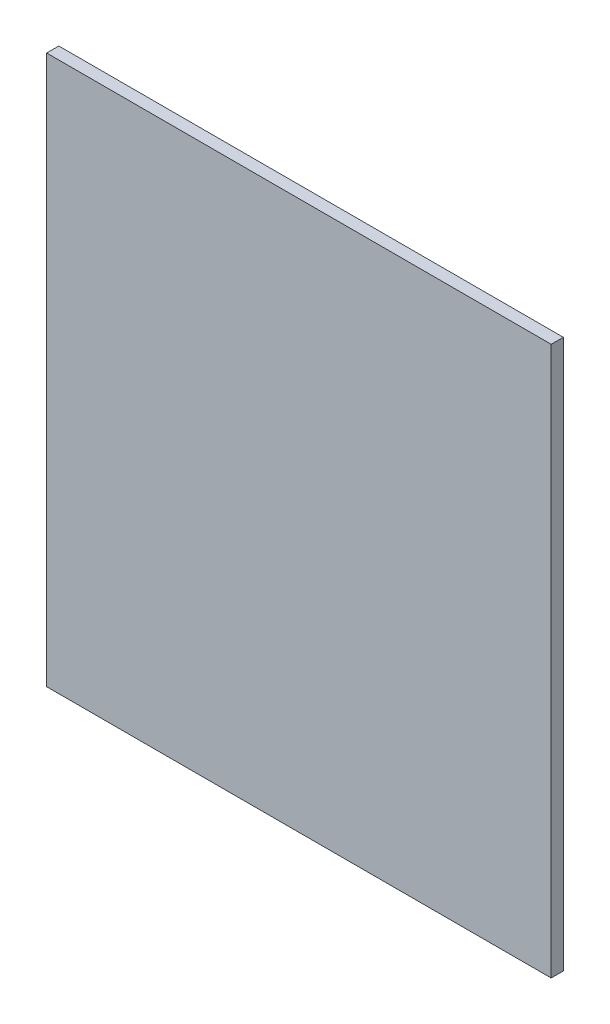
ISO-10303-21;
HEADER;
FILE_DESCRIPTION(('STEP AP214'),'2;1');
FILE_NAME('part.step','',(''),(''),'','','');
FILE_SCHEMA(('AUTOMOTIVE_DESIGN { 1 0 10303 214 1 1 1 1 }'));
ENDSEC;
DATA;
#1=APPLICATION_CONTEXT('core data for automotive mechanical design processes');
#2=APPLICATION_PROTOCOL_DEFINITION('international standard','automotive_design',2000,#1);
#3=PRODUCT_CONTEXT('',#1,'mechanical');
#4=PRODUCT('Part','Part','',(#3));
#5=PRODUCT_RELATED_PRODUCT_CATEGORY('part','',(#4));
#6=PRODUCT_DEFINITION_FORMATION('','',#4);
#7=PRODUCT_DEFINITION_CONTEXT('part definition',#1,'design');
#8=PRODUCT_DEFINITION('design','',#6,#7);
#9=PRODUCT_DEFINITION_SHAPE('','',#8);
#10=(LENGTH_UNIT() NAMED_UNIT(*) SI_UNIT(.MILLI.,.METRE.));
#11=(NAMED_UNIT(*) PLANE_ANGLE_UNIT() SI_UNIT($,.RADIAN.));
#12=(NAMED_UNIT(*) SI_UNIT($,.STERADIAN.) SOLID_ANGLE_UNIT());
#13=UNCERTAINTY_MEASURE_WITH_UNIT(LENGTH_MEASURE(1.E-05),#10,'distance_accuracy_value','');
#14=(GEOMETRIC_REPRESENTATION_CONTEXT(3) GLOBAL_UNCERTAINTY_ASSIGNED_CONTEXT((#13)) GLOBAL_UNIT_ASSIGNED_CONTEXT((#10,
#11,#12)) REPRESENTATION_CONTEXT('',''));
#15=CARTESIAN_POINT('',(0.,0.,0.));
#16=DIRECTION('',(0.,0.,1.));
#17=DIRECTION('',(1.,0.,0.));
#18=AXIS2_PLACEMENT_3D('',#15,#16,#17);
#19=CARTESIAN_POINT('',(-8.82499886,-9.59999858,0.42499788));
#20=DIRECTION('',(0.,0.,-1.));
#21=DIRECTION('',(0.,-1.,0.));
#22=AXIS2_PLACEMENT_3D('',#19,#20,#21);
#23=PLANE('',#22);
#24=DIRECTION('',(1.,0.,0.));
#25=VECTOR('',#24,1.);
#26=CARTESIAN_POINT('',(-8.82499886,-9.59999858,0.42499788));
#27=LINE('',#26,#25);
#28=CARTESIAN_POINT('',(-8.82499886,-9.59999858,0.42499788));
#29=VERTEX_POINT('',#28);
#30=CARTESIAN_POINT('',(8.8250014,-9.59999858,0.42499788));
#31=VERTEX_POINT('',#30);
#32=EDGE_CURVE('E21',#29,#31,#27,.T.);
#33=ORIENTED_EDGE('',*,*,#32,.T.);
#34=DIRECTION('',(0.,1.,0.));
#35=VECTOR('',#34,1.);
#36=CARTESIAN_POINT('',(8.8250014,-9.59999858,0.42499788));
#37=LINE('',#36,#35);
#38=CARTESIAN_POINT('',(8.8250014,9.60000112,0.42499788));
#39=VERTEX_POINT('',#38);
#40=EDGE_CURVE('E67',#31,#39,#37,.T.);
#41=ORIENTED_EDGE('',*,*,#40,.T.);
#42=DIRECTION('',(-1.,0.,0.));
#43=VECTOR('',#42,1.);
#44=CARTESIAN_POINT('',(8.8250014,9.60000112,0.42499788));
#45=LINE('',#44,#43);
#46=CARTESIAN_POINT('',(-8.82499886,9.60000112,0.42499788));
#47=VERTEX_POINT('',#46);
#48=EDGE_CURVE('E86',#39,#47,#45,.T.);
#49=ORIENTED_EDGE('',*,*,#48,.T.);
#50=DIRECTION('',(0.,-1.,0.));
#51=VECTOR('',#50,1.);
#52=CARTESIAN_POINT('',(-8.82499886,9.60000112,0.42499788));
#53=LINE('',#52,#51);
#54=EDGE_CURVE('E11',#47,#29,#53,.T.);
#55=ORIENTED_EDGE('',*,*,#54,.T.);
#56=EDGE_LOOP('',(#33,#41,#49,#55));
#57=FACE_BOUND('',#56,.T.);
#58=ADVANCED_FACE('F17',(#57),#23,.F.);
#59=CARTESIAN_POINT('',(-8.82499886,-9.59999858,0.));
#60=DIRECTION('',(0.,0.,-1.));
#61=DIRECTION('',(0.,-1.,0.));
#62=AXIS2_PLACEMENT_3D('',#59,#60,#61);
#63=PLANE('',#62);
#64=DIRECTION('',(1.,0.,0.));
#65=VECTOR('',#64,1.);
#66=CARTESIAN_POINT('',(-8.82499886,-9.59999858,0.));
#67=LINE('',#66,#65);
#68=CARTESIAN_POINT('',(-8.82499886,-9.59999858,0.));
#69=VERTEX_POINT('',#68);
#70=CARTESIAN_POINT('',(8.8250014,-9.59999858,0.));
#71=VERTEX_POINT('',#70);
#72=EDGE_CURVE('E99',#69,#71,#67,.T.);
#73=ORIENTED_EDGE('',*,*,#72,.F.);
#74=DIRECTION('',(0.,-1.,0.));
#75=VECTOR('',#74,1.);
#76=CARTESIAN_POINT('',(-8.82499886,9.60000112,0.));
#77=LINE('',#76,#75);
#78=CARTESIAN_POINT('',(-8.82499886,9.60000112,0.));
#79=VERTEX_POINT('',#78);
#80=EDGE_CURVE('E28',#79,#69,#77,.T.);
#81=ORIENTED_EDGE('',*,*,#80,.F.);
#82=DIRECTION('',(-1.,0.,0.));
#83=VECTOR('',#82,1.);
#84=CARTESIAN_POINT('',(8.8250014,9.60000112,0.));
#85=LINE('',#84,#83);
#86=CARTESIAN_POINT('',(8.8250014,9.60000112,0.));
#87=VERTEX_POINT('',#86);
#88=EDGE_CURVE('E74',#87,#79,#85,.T.);
#89=ORIENTED_EDGE('',*,*,#88,.F.);
#90=DIRECTION('',(0.,1.,0.));
#91=VECTOR('',#90,1.);
#92=CARTESIAN_POINT('',(8.8250014,-9.59999858,0.));
#93=LINE('',#92,#91);
#94=EDGE_CURVE('E78',#71,#87,#93,.T.);
#95=ORIENTED_EDGE('',*,*,#94,.F.);
#96=EDGE_LOOP('',(#73,#81,#89,#95));
#97=FACE_BOUND('',#96,.T.);
#98=ADVANCED_FACE('F19',(#97),#63,.T.);
#99=CARTESIAN_POINT('',(-8.82499886,9.60000112,0.));
#100=DIRECTION('',(1.,0.,0.));
#101=DIRECTION('',(0.,1.,0.));
#102=AXIS2_PLACEMENT_3D('',#99,#100,#101);
#103=PLANE('',#102);
#104=DIRECTION('',(0.,0.,1.));
#105=VECTOR('',#104,1.);
#106=CARTESIAN_POINT('',(-8.82499886,9.60000112,0.));
#107=LINE('',#106,#105);
#108=EDGE_CURVE('E82',#79,#47,#107,.T.);
#109=ORIENTED_EDGE('',*,*,#108,.F.);
#110=ORIENTED_EDGE('',*,*,#80,.T.);
#111=DIRECTION('',(0.,0.,1.));
#112=VECTOR('',#111,1.);
#113=CARTESIAN_POINT('',(-8.82499886,-9.59999858,0.));
#114=LINE('',#113,#112);
#115=EDGE_CURVE('E102',#69,#29,#114,.T.);
#116=ORIENTED_EDGE('',*,*,#115,.T.);
#117=ORIENTED_EDGE('',*,*,#54,.F.);
#118=EDGE_LOOP('',(#109,#110,#116,#117));
#119=FACE_BOUND('',#118,.T.);
#120=ADVANCED_FACE('F120',(#119),#103,.F.);
#121=CARTESIAN_POINT('',(8.8250014,9.60000112,0.));
#122=DIRECTION('',(0.,-1.,0.));
#123=DIRECTION('',(0.,0.,-1.));
#124=AXIS2_PLACEMENT_3D('',#121,#122,#123);
#125=PLANE('',#124);
#126=DIRECTION('',(0.,0.,1.));
#127=VECTOR('',#126,1.);
#128=CARTESIAN_POINT('',(8.8250014,9.60000112,0.));
#129=LINE('',#128,#127);
#130=EDGE_CURVE('E84',#87,#39,#129,.T.);
#131=ORIENTED_EDGE('',*,*,#130,.F.);
#132=ORIENTED_EDGE('',*,*,#88,.T.);
#133=ORIENTED_EDGE('',*,*,#108,.T.);
#134=ORIENTED_EDGE('',*,*,#48,.F.);
#135=EDGE_LOOP('',(#131,#132,#133,#134));
#136=FACE_BOUND('',#135,.T.);
#137=ADVANCED_FACE('F85',(#136),#125,.F.);
#138=CARTESIAN_POINT('',(8.8250014,-9.59999858,0.));
#139=DIRECTION('',(-1.,0.,0.));
#140=DIRECTION('',(0.,0.,1.));
#141=AXIS2_PLACEMENT_3D('',#138,#139,#140);
#142=PLANE('',#141);
#143=DIRECTION('',(0.,0.,1.));
#144=VECTOR('',#143,1.);
#145=CARTESIAN_POINT('',(8.8250014,-9.59999858,0.));
#146=LINE('',#145,#144);
#147=EDGE_CURVE('E91',#71,#31,#146,.T.);
#148=ORIENTED_EDGE('',*,*,#147,.F.);
#149=ORIENTED_EDGE('',*,*,#94,.T.);
#150=ORIENTED_EDGE('',*,*,#130,.T.);
#151=ORIENTED_EDGE('',*,*,#40,.F.);
#152=EDGE_LOOP('',(#148,#149,#150,#151));
#153=FACE_BOUND('',#152,.T.);
#154=ADVANCED_FACE('F89',(#153),#142,.F.);
#155=CARTESIAN_POINT('',(-8.82499886,-9.59999858,0.));
#156=DIRECTION('',(0.,1.,0.));
#157=DIRECTION('',(1.,0.,0.));
#158=AXIS2_PLACEMENT_3D('',#155,#156,#157);
#159=PLANE('',#158);
#160=ORIENTED_EDGE('',*,*,#115,.F.);
#161=ORIENTED_EDGE('',*,*,#72,.T.);
#162=ORIENTED_EDGE('',*,*,#147,.T.);
#163=ORIENTED_EDGE('',*,*,#32,.F.);
#164=EDGE_LOOP('',(#160,#161,#162,#163));
#165=FACE_BOUND('',#164,.T.);
#166=ADVANCED_FACE('F119',(#165),#159,.F.);
#167=CLOSED_SHELL('',(#58,#98,#120,#137,#154,#166));
#168=MANIFOLD_SOLID_BREP('B1',#167);
#169=ADVANCED_BREP_SHAPE_REPRESENTATION('',(#18,#168),#14);
#170=SHAPE_DEFINITION_REPRESENTATION(#9,#169);
ENDSEC;
END-ISO-10303-21;
